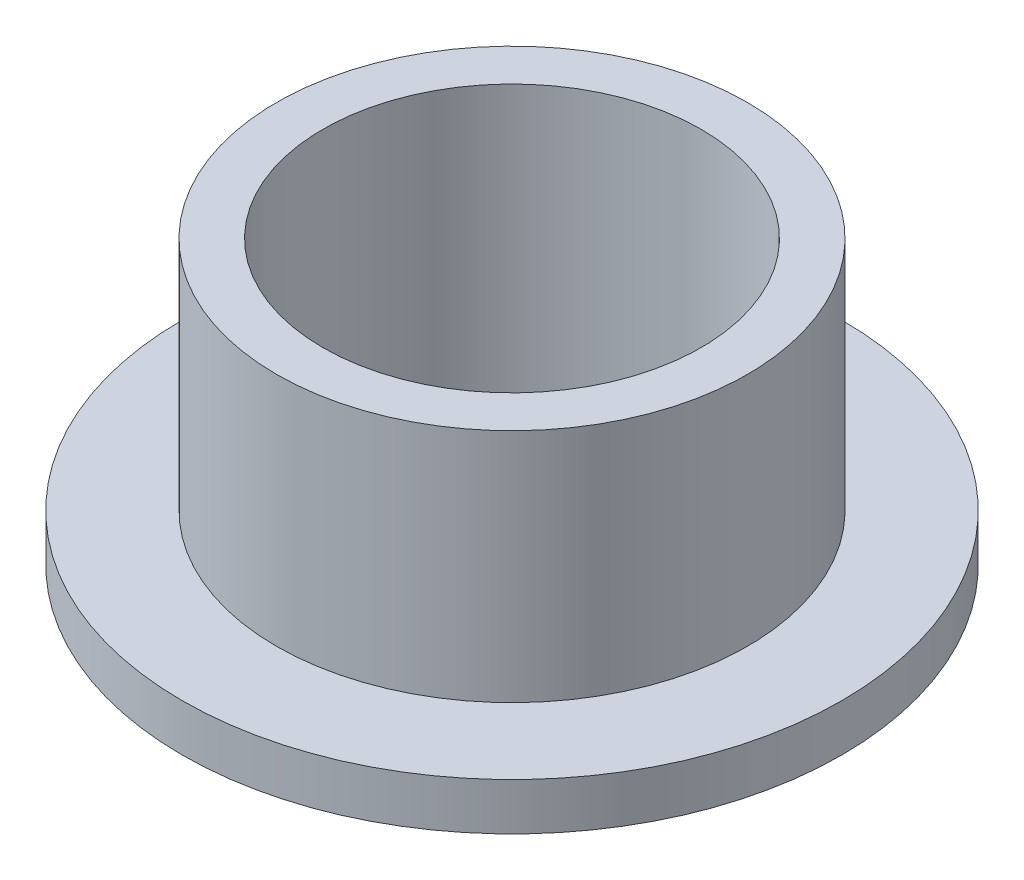
ISO-10303-21;
HEADER;
FILE_DESCRIPTION(('STEP AP214'),'2;1');
FILE_NAME('part.step','',(''),(''),'','','');
FILE_SCHEMA(('AUTOMOTIVE_DESIGN { 1 0 10303 214 1 1 1 1 }'));
ENDSEC;
DATA;
#1=APPLICATION_CONTEXT('core data for automotive mechanical design processes');
#2=APPLICATION_PROTOCOL_DEFINITION('international standard','automotive_design',2000,#1);
#3=PRODUCT_CONTEXT('',#1,'mechanical');
#4=PRODUCT('Part','Part','',(#3));
#5=PRODUCT_RELATED_PRODUCT_CATEGORY('part','',(#4));
#6=PRODUCT_DEFINITION_FORMATION('','',#4);
#7=PRODUCT_DEFINITION_CONTEXT('part definition',#1,'design');
#8=PRODUCT_DEFINITION('design','',#6,#7);
#9=PRODUCT_DEFINITION_SHAPE('','',#8);
#10=(LENGTH_UNIT() NAMED_UNIT(*) SI_UNIT(.MILLI.,.METRE.));
#11=(NAMED_UNIT(*) PLANE_ANGLE_UNIT() SI_UNIT($,.RADIAN.));
#12=(NAMED_UNIT(*) SI_UNIT($,.STERADIAN.) SOLID_ANGLE_UNIT());
#13=UNCERTAINTY_MEASURE_WITH_UNIT(LENGTH_MEASURE(1.E-05),#10,'distance_accuracy_value','');
#14=(GEOMETRIC_REPRESENTATION_CONTEXT(3) GLOBAL_UNCERTAINTY_ASSIGNED_CONTEXT((#13)) GLOBAL_UNIT_ASSIGNED_CONTEXT((#10,
#11,#12)) REPRESENTATION_CONTEXT('',''));
#15=CARTESIAN_POINT('',(0.,0.,0.));
#16=DIRECTION('',(0.,0.,1.));
#17=DIRECTION('',(1.,0.,0.));
#18=AXIS2_PLACEMENT_3D('',#15,#16,#17);
#19=CARTESIAN_POINT('',(0.,9.52500000000001,0.));
#20=DIRECTION('',(0.,1.,0.));
#21=DIRECTION('',(0.,0.,1.));
#22=AXIS2_PLACEMENT_3D('',#19,#20,#21);
#23=PLANE('',#22);
#24=CARTESIAN_POINT('',(0.,9.52500000000001,0.));
#25=DIRECTION('',(0.,1.,0.));
#26=DIRECTION('',(0.,0.,1.));
#27=AXIS2_PLACEMENT_3D('',#24,#25,#26);
#28=CIRCLE('',#27,7.9375);
#29=CARTESIAN_POINT('',(0.,9.52500000000001,7.93750000000001));
#30=VERTEX_POINT('',#29);
#31=EDGE_CURVE('E10',#30,#30,#28,.T.);
#32=ORIENTED_EDGE('',*,*,#31,.T.);
#33=EDGE_LOOP('',(#32));
#34=FACE_BOUND('',#33,.T.);
#35=CARTESIAN_POINT('',(0.,9.52500000000001,0.));
#36=DIRECTION('',(0.,1.,0.));
#37=DIRECTION('',(0.,0.,1.));
#38=AXIS2_PLACEMENT_3D('',#35,#36,#37);
#39=CIRCLE('',#38,6.3754);
#40=CARTESIAN_POINT('',(0.,9.52500000000001,6.37540000000001));
#41=VERTEX_POINT('',#40);
#42=EDGE_CURVE('E43',#41,#41,#39,.T.);
#43=ORIENTED_EDGE('',*,*,#42,.F.);
#44=EDGE_LOOP('',(#43));
#45=FACE_BOUND('',#44,.T.);
#46=ADVANCED_FACE('F36',(#34,#45),#23,.T.);
#47=CARTESIAN_POINT('',(0.,0.,0.));
#48=DIRECTION('',(0.,1.,0.));
#49=DIRECTION('',(0.,0.,1.));
#50=AXIS2_PLACEMENT_3D('',#47,#48,#49);
#51=PLANE('',#50);
#52=CARTESIAN_POINT('',(0.,0.,0.));
#53=DIRECTION('',(0.,1.,0.));
#54=DIRECTION('',(0.,0.,1.));
#55=AXIS2_PLACEMENT_3D('',#52,#53,#54);
#56=CIRCLE('',#55,6.3754);
#57=CARTESIAN_POINT('',(0.,0.,6.37540000000001));
#58=VERTEX_POINT('',#57);
#59=EDGE_CURVE('E47',#58,#58,#56,.T.);
#60=ORIENTED_EDGE('',*,*,#59,.T.);
#61=EDGE_LOOP('',(#60));
#62=FACE_BOUND('',#61,.T.);
#63=CARTESIAN_POINT('',(0.,0.,0.));
#64=DIRECTION('',(0.,1.,0.));
#65=DIRECTION('',(0.,0.,1.));
#66=AXIS2_PLACEMENT_3D('',#63,#64,#65);
#67=CIRCLE('',#66,11.1125);
#68=CARTESIAN_POINT('',(0.,0.,11.1125));
#69=VERTEX_POINT('',#68);
#70=EDGE_CURVE('E54',#69,#69,#67,.T.);
#71=ORIENTED_EDGE('',*,*,#70,.F.);
#72=EDGE_LOOP('',(#71));
#73=FACE_BOUND('',#72,.T.);
#74=ADVANCED_FACE('F79',(#62,#73),#51,.F.);
#75=CARTESIAN_POINT('',(0.,9.52500000000001,0.));
#76=DIRECTION('',(0.,-1.,0.));
#77=DIRECTION('',(0.,0.,-1.));
#78=AXIS2_PLACEMENT_3D('',#75,#76,#77);
#79=CYLINDRICAL_SURFACE('',#78,7.9375);
#80=CARTESIAN_POINT('',(0.,1.58750000000001,0.));
#81=DIRECTION('',(0.,1.,0.));
#82=DIRECTION('',(0.,0.,1.));
#83=AXIS2_PLACEMENT_3D('',#80,#81,#82);
#84=CIRCLE('',#83,7.9375);
#85=CARTESIAN_POINT('',(0.,1.58750000000001,7.93750000000001));
#86=VERTEX_POINT('',#85);
#87=EDGE_CURVE('E57',#86,#86,#84,.T.);
#88=ORIENTED_EDGE('',*,*,#87,.T.);
#89=EDGE_LOOP('',(#88));
#90=FACE_BOUND('',#89,.T.);
#91=ORIENTED_EDGE('',*,*,#31,.F.);
#92=EDGE_LOOP('',(#91));
#93=FACE_BOUND('',#92,.T.);
#94=ADVANCED_FACE('F38',(#90,#93),#79,.T.);
#95=CARTESIAN_POINT('',(0.,9.52500000000001,0.));
#96=DIRECTION('',(0.,-1.,0.));
#97=DIRECTION('',(0.,0.,-1.));
#98=AXIS2_PLACEMENT_3D('',#95,#96,#97);
#99=CYLINDRICAL_SURFACE('',#98,6.3754);
#100=ORIENTED_EDGE('',*,*,#42,.T.);
#101=EDGE_LOOP('',(#100));
#102=FACE_BOUND('',#101,.T.);
#103=ORIENTED_EDGE('',*,*,#59,.F.);
#104=EDGE_LOOP('',(#103));
#105=FACE_BOUND('',#104,.T.);
#106=ADVANCED_FACE('F68',(#102,#105),#99,.F.);
#107=CARTESIAN_POINT('',(0.,1.58750000000001,0.));
#108=DIRECTION('',(0.,1.,0.));
#109=DIRECTION('',(0.,0.,1.));
#110=AXIS2_PLACEMENT_3D('',#107,#108,#109);
#111=PLANE('',#110);
#112=CARTESIAN_POINT('',(0.,1.58750000000001,0.));
#113=DIRECTION('',(0.,1.,0.));
#114=DIRECTION('',(0.,0.,1.));
#115=AXIS2_PLACEMENT_3D('',#112,#113,#114);
#116=CIRCLE('',#115,11.1125);
#117=CARTESIAN_POINT('',(0.,1.58750000000001,11.1125));
#118=VERTEX_POINT('',#117);
#119=EDGE_CURVE('E52',#118,#118,#116,.T.);
#120=ORIENTED_EDGE('',*,*,#119,.T.);
#121=EDGE_LOOP('',(#120));
#122=FACE_BOUND('',#121,.T.);
#123=ORIENTED_EDGE('',*,*,#87,.F.);
#124=EDGE_LOOP('',(#123));
#125=FACE_BOUND('',#124,.T.);
#126=ADVANCED_FACE('F65',(#122,#125),#111,.T.);
#127=CARTESIAN_POINT('',(0.,1.58750000000001,0.));
#128=DIRECTION('',(0.,-1.,0.));
#129=DIRECTION('',(0.,0.,-1.));
#130=AXIS2_PLACEMENT_3D('',#127,#128,#129);
#131=CYLINDRICAL_SURFACE('',#130,11.1125);
#132=ORIENTED_EDGE('',*,*,#119,.F.);
#133=EDGE_LOOP('',(#132));
#134=FACE_BOUND('',#133,.T.);
#135=ORIENTED_EDGE('',*,*,#70,.T.);
#136=EDGE_LOOP('',(#135));
#137=FACE_BOUND('',#136,.T.);
#138=ADVANCED_FACE('F67',(#134,#137),#131,.T.);
#139=CLOSED_SHELL('',(#46,#74,#94,#106,#126,#138));
#140=MANIFOLD_SOLID_BREP('B2',#139);
#141=ADVANCED_BREP_SHAPE_REPRESENTATION('',(#18,#140),#14);
#142=SHAPE_DEFINITION_REPRESENTATION(#9,#141);
ENDSEC;
END-ISO-10303-21;
